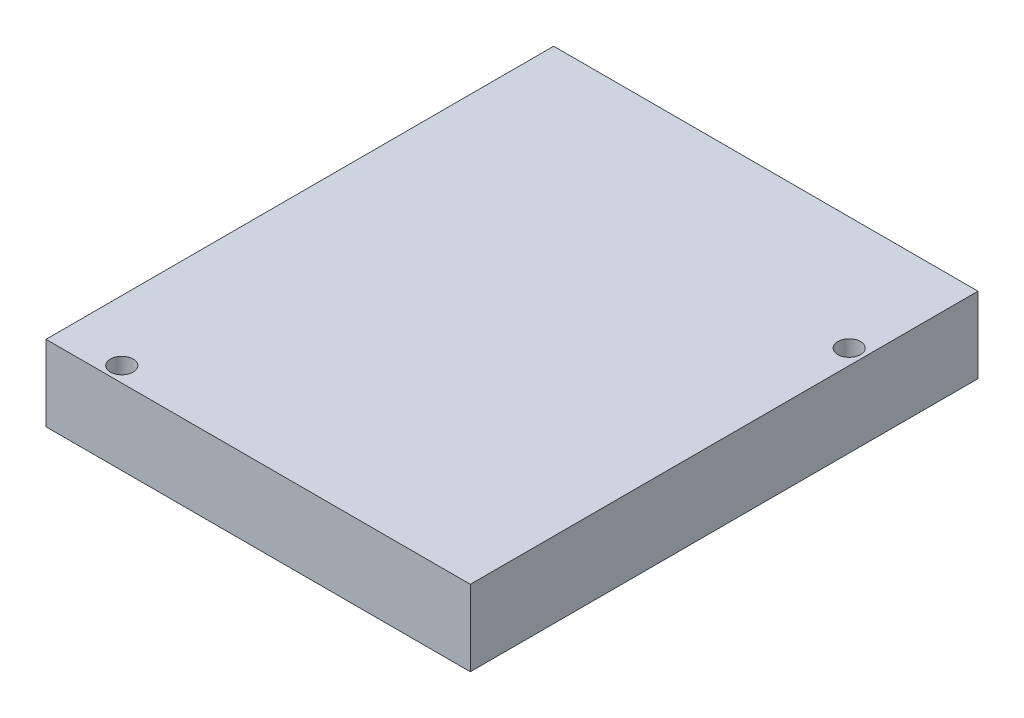
ISO-10303-21;
HEADER;
FILE_DESCRIPTION(('STEP AP214'),'2;1');
FILE_NAME('part.step','',(''),(''),'','','');
FILE_SCHEMA(('AUTOMOTIVE_DESIGN { 1 0 10303 214 1 1 1 1 }'));
ENDSEC;
DATA;
#1=APPLICATION_CONTEXT('core data for automotive mechanical design processes');
#2=APPLICATION_PROTOCOL_DEFINITION('international standard','automotive_design',2000,#1);
#3=PRODUCT_CONTEXT('',#1,'mechanical');
#4=PRODUCT('Part','Part','',(#3));
#5=PRODUCT_RELATED_PRODUCT_CATEGORY('part','',(#4));
#6=PRODUCT_DEFINITION_FORMATION('','',#4);
#7=PRODUCT_DEFINITION_CONTEXT('part definition',#1,'design');
#8=PRODUCT_DEFINITION('design','',#6,#7);
#9=PRODUCT_DEFINITION_SHAPE('','',#8);
#10=(LENGTH_UNIT() NAMED_UNIT(*) SI_UNIT(.MILLI.,.METRE.));
#11=(NAMED_UNIT(*) PLANE_ANGLE_UNIT() SI_UNIT($,.RADIAN.));
#12=(NAMED_UNIT(*) SI_UNIT($,.STERADIAN.) SOLID_ANGLE_UNIT());
#13=UNCERTAINTY_MEASURE_WITH_UNIT(LENGTH_MEASURE(1.E-05),#10,'distance_accuracy_value','');
#14=(GEOMETRIC_REPRESENTATION_CONTEXT(3) GLOBAL_UNCERTAINTY_ASSIGNED_CONTEXT((#13)) GLOBAL_UNIT_ASSIGNED_CONTEXT((#10,
#11,#12)) REPRESENTATION_CONTEXT('',''));
#15=CARTESIAN_POINT('',(0.,0.,0.));
#16=DIRECTION('',(0.,0.,1.));
#17=DIRECTION('',(1.,0.,0.));
#18=AXIS2_PLACEMENT_3D('',#15,#16,#17);
#19=CARTESIAN_POINT('',(0.,10.,0.));
#20=DIRECTION('',(0.,1.,0.));
#21=DIRECTION('',(0.,0.,1.));
#22=AXIS2_PLACEMENT_3D('',#19,#20,#21);
#23=PLANE('',#22);
#24=CARTESIAN_POINT('',(26.,10.,-18.5));
#25=DIRECTION('',(0.,1.,0.));
#26=DIRECTION('',(0.,0.,1.));
#27=AXIS2_PLACEMENT_3D('',#24,#25,#26);
#28=CIRCLE('',#27,1.5);
#29=CARTESIAN_POINT('',(26.,10.,-17.));
#30=VERTEX_POINT('',#29);
#31=EDGE_CURVE('E102',#30,#30,#28,.T.);
#32=ORIENTED_EDGE('',*,*,#31,.F.);
#33=EDGE_LOOP('',(#32));
#34=FACE_BOUND('',#33,.T.);
#35=DIRECTION('',(0.,0.,-1.));
#36=VECTOR('',#35,1.);
#37=CARTESIAN_POINT('',(28.,10.,-33.5));
#38=LINE('',#37,#36);
#39=CARTESIAN_POINT('',(28.,10.,33.5));
#40=VERTEX_POINT('',#39);
#41=CARTESIAN_POINT('',(28.,10.,-33.5));
#42=VERTEX_POINT('',#41);
#43=EDGE_CURVE('E87',#40,#42,#38,.T.);
#44=ORIENTED_EDGE('',*,*,#43,.T.);
#45=DIRECTION('',(-1.,0.,0.));
#46=VECTOR('',#45,1.);
#47=CARTESIAN_POINT('',(-28.,10.,-33.5));
#48=LINE('',#47,#46);
#49=CARTESIAN_POINT('',(-28.,10.,-33.5));
#50=VERTEX_POINT('',#49);
#51=EDGE_CURVE('E82',#42,#50,#48,.T.);
#52=ORIENTED_EDGE('',*,*,#51,.T.);
#53=DIRECTION('',(0.,0.,1.));
#54=VECTOR('',#53,1.);
#55=CARTESIAN_POINT('',(-28.,10.,-33.5));
#56=LINE('',#55,#54);
#57=CARTESIAN_POINT('',(-28.,10.,33.5));
#58=VERTEX_POINT('',#57);
#59=EDGE_CURVE('E85',#50,#58,#56,.T.);
#60=ORIENTED_EDGE('',*,*,#59,.T.);
#61=DIRECTION('',(1.,0.,0.));
#62=VECTOR('',#61,1.);
#63=CARTESIAN_POINT('',(-28.,10.,33.5));
#64=LINE('',#63,#62);
#65=EDGE_CURVE('E52',#58,#40,#64,.T.);
#66=ORIENTED_EDGE('',*,*,#65,.T.);
#67=EDGE_LOOP('',(#44,#52,#60,#66));
#68=FACE_BOUND('',#67,.T.);
#69=CARTESIAN_POINT('',(-20.,10.,31.5));
#70=DIRECTION('',(0.,1.,0.));
#71=DIRECTION('',(0.,0.,1.));
#72=AXIS2_PLACEMENT_3D('',#69,#70,#71);
#73=CIRCLE('',#72,1.5);
#74=CARTESIAN_POINT('',(-20.,10.,33.));
#75=VERTEX_POINT('',#74);
#76=EDGE_CURVE('E117',#75,#75,#73,.T.);
#77=ORIENTED_EDGE('',*,*,#76,.F.);
#78=EDGE_LOOP('',(#77));
#79=FACE_BOUND('',#78,.T.);
#80=ADVANCED_FACE('F35',(#34,#68,#79),#23,.T.);
#81=CARTESIAN_POINT('',(0.,0.,0.));
#82=DIRECTION('',(0.,1.,0.));
#83=DIRECTION('',(0.,0.,1.));
#84=AXIS2_PLACEMENT_3D('',#81,#82,#83);
#85=PLANE('',#84);
#86=DIRECTION('',(0.,0.,-1.));
#87=VECTOR('',#86,1.);
#88=CARTESIAN_POINT('',(28.,0.,-33.5));
#89=LINE('',#88,#87);
#90=CARTESIAN_POINT('',(28.,0.,33.5));
#91=VERTEX_POINT('',#90);
#92=CARTESIAN_POINT('',(28.,0.,-33.5));
#93=VERTEX_POINT('',#92);
#94=EDGE_CURVE('E99',#91,#93,#89,.T.);
#95=ORIENTED_EDGE('',*,*,#94,.F.);
#96=DIRECTION('',(1.,0.,0.));
#97=VECTOR('',#96,1.);
#98=CARTESIAN_POINT('',(-28.,0.,33.5));
#99=LINE('',#98,#97);
#100=CARTESIAN_POINT('',(-28.,0.,33.5));
#101=VERTEX_POINT('',#100);
#102=EDGE_CURVE('E75',#101,#91,#99,.T.);
#103=ORIENTED_EDGE('',*,*,#102,.F.);
#104=DIRECTION('',(0.,0.,1.));
#105=VECTOR('',#104,1.);
#106=CARTESIAN_POINT('',(-28.,0.,-33.5));
#107=LINE('',#106,#105);
#108=CARTESIAN_POINT('',(-28.,0.,-33.5));
#109=VERTEX_POINT('',#108);
#110=EDGE_CURVE('E69',#109,#101,#107,.T.);
#111=ORIENTED_EDGE('',*,*,#110,.F.);
#112=DIRECTION('',(-1.,0.,0.));
#113=VECTOR('',#112,1.);
#114=CARTESIAN_POINT('',(-28.,0.,-33.5));
#115=LINE('',#114,#113);
#116=EDGE_CURVE('E91',#93,#109,#115,.T.);
#117=ORIENTED_EDGE('',*,*,#116,.F.);
#118=EDGE_LOOP('',(#95,#103,#111,#117));
#119=FACE_BOUND('',#118,.T.);
#120=CARTESIAN_POINT('',(26.,0.,-18.5));
#121=DIRECTION('',(0.,1.,0.));
#122=DIRECTION('',(0.,0.,1.));
#123=AXIS2_PLACEMENT_3D('',#120,#121,#122);
#124=CIRCLE('',#123,1.5);
#125=CARTESIAN_POINT('',(26.,0.,-17.));
#126=VERTEX_POINT('',#125);
#127=EDGE_CURVE('E114',#126,#126,#124,.T.);
#128=ORIENTED_EDGE('',*,*,#127,.T.);
#129=EDGE_LOOP('',(#128));
#130=FACE_BOUND('',#129,.T.);
#131=CARTESIAN_POINT('',(-20.,0.,31.5));
#132=DIRECTION('',(0.,1.,0.));
#133=DIRECTION('',(0.,0.,1.));
#134=AXIS2_PLACEMENT_3D('',#131,#132,#133);
#135=CIRCLE('',#134,1.5);
#136=CARTESIAN_POINT('',(-20.,0.,33.));
#137=VERTEX_POINT('',#136);
#138=EDGE_CURVE('E120',#137,#137,#135,.T.);
#139=ORIENTED_EDGE('',*,*,#138,.T.);
#140=EDGE_LOOP('',(#139));
#141=FACE_BOUND('',#140,.T.);
#142=ADVANCED_FACE('F110',(#119,#130,#141),#85,.F.);
#143=CARTESIAN_POINT('',(28.,10.,-33.5));
#144=DIRECTION('',(-1.,0.,0.));
#145=DIRECTION('',(0.,0.,1.));
#146=AXIS2_PLACEMENT_3D('',#143,#144,#145);
#147=PLANE('',#146);
#148=ORIENTED_EDGE('',*,*,#94,.T.);
#149=DIRECTION('',(0.,-1.,0.));
#150=VECTOR('',#149,1.);
#151=CARTESIAN_POINT('',(28.,10.,-33.5));
#152=LINE('',#151,#150);
#153=EDGE_CURVE('E11',#42,#93,#152,.T.);
#154=ORIENTED_EDGE('',*,*,#153,.F.);
#155=ORIENTED_EDGE('',*,*,#43,.F.);
#156=DIRECTION('',(0.,-1.,0.));
#157=VECTOR('',#156,1.);
#158=CARTESIAN_POINT('',(28.,10.,33.5));
#159=LINE('',#158,#157);
#160=EDGE_CURVE('E95',#40,#91,#159,.T.);
#161=ORIENTED_EDGE('',*,*,#160,.T.);
#162=EDGE_LOOP('',(#148,#154,#155,#161));
#163=FACE_BOUND('',#162,.T.);
#164=ADVANCED_FACE('F37',(#163),#147,.F.);
#165=CARTESIAN_POINT('',(-28.,10.,-33.5));
#166=DIRECTION('',(0.,0.,1.));
#167=DIRECTION('',(1.,0.,0.));
#168=AXIS2_PLACEMENT_3D('',#165,#166,#167);
#169=PLANE('',#168);
#170=ORIENTED_EDGE('',*,*,#116,.T.);
#171=DIRECTION('',(0.,-1.,0.));
#172=VECTOR('',#171,1.);
#173=CARTESIAN_POINT('',(-28.,10.,-33.5));
#174=LINE('',#173,#172);
#175=EDGE_CURVE('E44',#50,#109,#174,.T.);
#176=ORIENTED_EDGE('',*,*,#175,.F.);
#177=ORIENTED_EDGE('',*,*,#51,.F.);
#178=ORIENTED_EDGE('',*,*,#153,.T.);
#179=EDGE_LOOP('',(#170,#176,#177,#178));
#180=FACE_BOUND('',#179,.T.);
#181=ADVANCED_FACE('F90',(#180),#169,.F.);
#182=CARTESIAN_POINT('',(-28.,10.,-33.5));
#183=DIRECTION('',(1.,0.,0.));
#184=DIRECTION('',(0.,0.,-1.));
#185=AXIS2_PLACEMENT_3D('',#182,#183,#184);
#186=PLANE('',#185);
#187=ORIENTED_EDGE('',*,*,#110,.T.);
#188=DIRECTION('',(0.,-1.,0.));
#189=VECTOR('',#188,1.);
#190=CARTESIAN_POINT('',(-28.,10.,33.5));
#191=LINE('',#190,#189);
#192=EDGE_CURVE('E92',#58,#101,#191,.T.);
#193=ORIENTED_EDGE('',*,*,#192,.F.);
#194=ORIENTED_EDGE('',*,*,#59,.F.);
#195=ORIENTED_EDGE('',*,*,#175,.T.);
#196=EDGE_LOOP('',(#187,#193,#194,#195));
#197=FACE_BOUND('',#196,.T.);
#198=ADVANCED_FACE('F93',(#197),#186,.F.);
#199=CARTESIAN_POINT('',(-28.,10.,33.5));
#200=DIRECTION('',(0.,0.,-1.));
#201=DIRECTION('',(-1.,0.,0.));
#202=AXIS2_PLACEMENT_3D('',#199,#200,#201);
#203=PLANE('',#202);
#204=ORIENTED_EDGE('',*,*,#102,.T.);
#205=ORIENTED_EDGE('',*,*,#160,.F.);
#206=ORIENTED_EDGE('',*,*,#65,.F.);
#207=ORIENTED_EDGE('',*,*,#192,.T.);
#208=EDGE_LOOP('',(#204,#205,#206,#207));
#209=FACE_BOUND('',#208,.T.);
#210=ADVANCED_FACE('F107',(#209),#203,.F.);
#211=CARTESIAN_POINT('',(26.,10.,-18.5));
#212=DIRECTION('',(0.,-1.,0.));
#213=DIRECTION('',(0.,0.,-1.));
#214=AXIS2_PLACEMENT_3D('',#211,#212,#213);
#215=CYLINDRICAL_SURFACE('',#214,1.5);
#216=ORIENTED_EDGE('',*,*,#31,.T.);
#217=EDGE_LOOP('',(#216));
#218=FACE_BOUND('',#217,.T.);
#219=ORIENTED_EDGE('',*,*,#127,.F.);
#220=EDGE_LOOP('',(#219));
#221=FACE_BOUND('',#220,.T.);
#222=ADVANCED_FACE('F137',(#218,#221),#215,.F.);
#223=CARTESIAN_POINT('',(-20.,10.,31.5));
#224=DIRECTION('',(0.,-1.,0.));
#225=DIRECTION('',(0.,0.,-1.));
#226=AXIS2_PLACEMENT_3D('',#223,#224,#225);
#227=CYLINDRICAL_SURFACE('',#226,1.5);
#228=ORIENTED_EDGE('',*,*,#76,.T.);
#229=EDGE_LOOP('',(#228));
#230=FACE_BOUND('',#229,.T.);
#231=ORIENTED_EDGE('',*,*,#138,.F.);
#232=EDGE_LOOP('',(#231));
#233=FACE_BOUND('',#232,.T.);
#234=ADVANCED_FACE('F126',(#230,#233),#227,.F.);
#235=CLOSED_SHELL('',(#80,#142,#164,#181,#198,#210,#222,#234));
#236=MANIFOLD_SOLID_BREP('B2',#235);
#237=ADVANCED_BREP_SHAPE_REPRESENTATION('',(#18,#236),#14);
#238=SHAPE_DEFINITION_REPRESENTATION(#9,#237);
ENDSEC;
END-ISO-10303-21;
